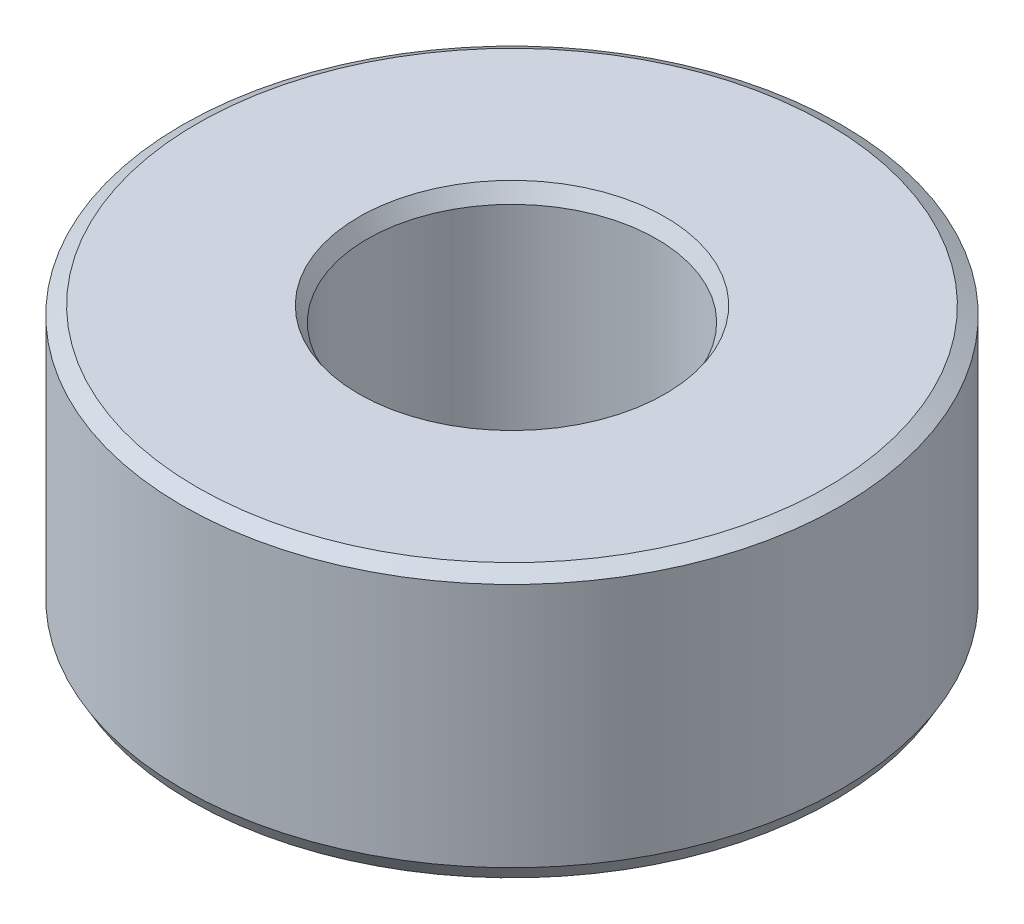
ISO-10303-21;
HEADER;
FILE_DESCRIPTION(('STEP AP214'),'2;1');
FILE_NAME('part.step','',(''),(''),'','','');
FILE_SCHEMA(('AUTOMOTIVE_DESIGN { 1 0 10303 214 1 1 1 1 }'));
ENDSEC;
DATA;
#1=APPLICATION_CONTEXT('core data for automotive mechanical design processes');
#2=APPLICATION_PROTOCOL_DEFINITION('international standard','automotive_design',2000,#1);
#3=PRODUCT_CONTEXT('',#1,'mechanical');
#4=PRODUCT('Part','Part','',(#3));
#5=PRODUCT_RELATED_PRODUCT_CATEGORY('part','',(#4));
#6=PRODUCT_DEFINITION_FORMATION('','',#4);
#7=PRODUCT_DEFINITION_CONTEXT('part definition',#1,'design');
#8=PRODUCT_DEFINITION('design','',#6,#7);
#9=PRODUCT_DEFINITION_SHAPE('','',#8);
#10=(LENGTH_UNIT() NAMED_UNIT(*) SI_UNIT(.MILLI.,.METRE.));
#11=(NAMED_UNIT(*) PLANE_ANGLE_UNIT() SI_UNIT($,.RADIAN.));
#12=(NAMED_UNIT(*) SI_UNIT($,.STERADIAN.) SOLID_ANGLE_UNIT());
#13=UNCERTAINTY_MEASURE_WITH_UNIT(LENGTH_MEASURE(1.E-05),#10,'distance_accuracy_value','');
#14=(GEOMETRIC_REPRESENTATION_CONTEXT(3) GLOBAL_UNCERTAINTY_ASSIGNED_CONTEXT((#13)) GLOBAL_UNIT_ASSIGNED_CONTEXT((#10,
#11,#12)) REPRESENTATION_CONTEXT('',''));
#15=CARTESIAN_POINT('',(0.,0.,0.));
#16=DIRECTION('',(0.,0.,1.));
#17=DIRECTION('',(1.,0.,0.));
#18=AXIS2_PLACEMENT_3D('',#15,#16,#17);
#19=CARTESIAN_POINT('',(0.,30.5505420791379,0.));
#20=DIRECTION('',(0.,-1.,0.));
#21=DIRECTION('',(0.,0.,-1.));
#22=AXIS2_PLACEMENT_3D('',#19,#20,#21);
#23=CYLINDRICAL_SURFACE('',#22,37.5);
#24=CARTESIAN_POINT('',(0.,1.67887617685251,0.));
#25=DIRECTION('',(0.,1.,0.));
#26=DIRECTION('',(0.,0.,1.));
#27=AXIS2_PLACEMENT_3D('',#24,#25,#26);
#28=CIRCLE('',#27,37.5);
#29=CARTESIAN_POINT('',(0.,1.67887617685251,37.5));
#30=VERTEX_POINT('',#29);
#31=EDGE_CURVE('E10',#30,#30,#28,.T.);
#32=ORIENTED_EDGE('',*,*,#31,.T.);
#33=EDGE_LOOP('',(#32));
#34=FACE_BOUND('',#33,.T.);
#35=CARTESIAN_POINT('',(0.,29.581242466496,0.));
#36=DIRECTION('',(0.,1.,0.));
#37=DIRECTION('',(0.,0.,1.));
#38=AXIS2_PLACEMENT_3D('',#35,#36,#37);
#39=CIRCLE('',#38,37.5);
#40=CARTESIAN_POINT('',(0.,29.581242466496,37.5));
#41=VERTEX_POINT('',#40);
#42=EDGE_CURVE('E50',#41,#41,#39,.F.);
#43=ORIENTED_EDGE('',*,*,#42,.T.);
#44=EDGE_LOOP('',(#43));
#45=FACE_BOUND('',#44,.T.);
#46=ADVANCED_FACE('F39',(#34,#45),#23,.T.);
#47=CARTESIAN_POINT('',(0.,30.5505420791379,0.));
#48=DIRECTION('',(0.,1.,0.));
#49=DIRECTION('',(0.,0.,1.));
#50=AXIS2_PLACEMENT_3D('',#47,#48,#49);
#51=PLANE('',#50);
#52=CARTESIAN_POINT('',(0.,30.5505420791379,0.));
#53=DIRECTION('',(0.,1.,0.));
#54=DIRECTION('',(0.,0.,1.));
#55=AXIS2_PLACEMENT_3D('',#52,#53,#54);
#56=CIRCLE('',#55,17.4312674834398);
#57=CARTESIAN_POINT('',(0.,30.5505420791379,17.4312674834398));
#58=VERTEX_POINT('',#57);
#59=EDGE_CURVE('E58',#58,#58,#56,.F.);
#60=ORIENTED_EDGE('',*,*,#59,.T.);
#61=EDGE_LOOP('',(#60));
#62=FACE_BOUND('',#61,.T.);
#63=CARTESIAN_POINT('',(0.,30.5505420791379,0.));
#64=DIRECTION('',(0.,1.,0.));
#65=DIRECTION('',(0.,0.,1.));
#66=AXIS2_PLACEMENT_3D('',#63,#64,#65);
#67=CIRCLE('',#66,35.8211238231475);
#68=CARTESIAN_POINT('',(0.,30.5505420791379,35.8211238231475));
#69=VERTEX_POINT('',#68);
#70=EDGE_CURVE('E61',#69,#69,#67,.T.);
#71=ORIENTED_EDGE('',*,*,#70,.T.);
#72=EDGE_LOOP('',(#71));
#73=FACE_BOUND('',#72,.T.);
#74=ADVANCED_FACE('F88',(#62,#73),#51,.T.);
#75=CARTESIAN_POINT('',(0.,0.,0.));
#76=DIRECTION('',(0.,1.,0.));
#77=DIRECTION('',(0.,0.,1.));
#78=AXIS2_PLACEMENT_3D('',#75,#76,#77);
#79=PLANE('',#78);
#80=CARTESIAN_POINT('',(0.,0.,0.));
#81=DIRECTION('',(0.,1.,0.));
#82=DIRECTION('',(0.,0.,1.));
#83=AXIS2_PLACEMENT_3D('',#80,#81,#82);
#84=CIRCLE('',#83,18.1408440476504);
#85=CARTESIAN_POINT('',(0.,0.,18.1408440476504));
#86=VERTEX_POINT('',#85);
#87=EDGE_CURVE('E51',#86,#86,#84,.T.);
#88=ORIENTED_EDGE('',*,*,#87,.T.);
#89=EDGE_LOOP('',(#88));
#90=FACE_BOUND('',#89,.T.);
#91=CARTESIAN_POINT('',(0.,0.,0.));
#92=DIRECTION('',(0.,1.,0.));
#93=DIRECTION('',(0.,0.,1.));
#94=AXIS2_PLACEMENT_3D('',#91,#92,#93);
#95=CIRCLE('',#94,36.5307003873581);
#96=CARTESIAN_POINT('',(0.,0.,36.5307003873581));
#97=VERTEX_POINT('',#96);
#98=EDGE_CURVE('E54',#97,#97,#95,.F.);
#99=ORIENTED_EDGE('',*,*,#98,.T.);
#100=EDGE_LOOP('',(#99));
#101=FACE_BOUND('',#100,.T.);
#102=ADVANCED_FACE('F83',(#90,#101),#79,.F.);
#103=CARTESIAN_POINT('',(0.,30.5505420791379,0.));
#104=DIRECTION('',(0.,-1.,0.));
#105=DIRECTION('',(0.,0.,-1.));
#106=AXIS2_PLACEMENT_3D('',#103,#104,#105);
#107=CYLINDRICAL_SURFACE('',#106,16.4619678707979);
#108=CARTESIAN_POINT('',(0.,28.8716659022853,0.));
#109=DIRECTION('',(0.,1.,0.));
#110=DIRECTION('',(0.,0.,1.));
#111=AXIS2_PLACEMENT_3D('',#108,#109,#110);
#112=CIRCLE('',#111,16.4619678707979);
#113=CARTESIAN_POINT('',(0.,28.8716659022853,16.4619678707979));
#114=VERTEX_POINT('',#113);
#115=EDGE_CURVE('E67',#114,#114,#112,.T.);
#116=ORIENTED_EDGE('',*,*,#115,.T.);
#117=EDGE_LOOP('',(#116));
#118=FACE_BOUND('',#117,.T.);
#119=CARTESIAN_POINT('',(0.,0.969299612641875,0.));
#120=DIRECTION('',(0.,1.,0.));
#121=DIRECTION('',(0.,0.,1.));
#122=AXIS2_PLACEMENT_3D('',#119,#120,#121);
#123=CIRCLE('',#122,16.4619678707979);
#124=CARTESIAN_POINT('',(0.,0.969299612641875,16.4619678707979));
#125=VERTEX_POINT('',#124);
#126=EDGE_CURVE('E69',#125,#125,#123,.F.);
#127=ORIENTED_EDGE('',*,*,#126,.T.);
#128=EDGE_LOOP('',(#127));
#129=FACE_BOUND('',#128,.T.);
#130=ADVANCED_FACE('F71',(#118,#129),#107,.F.);
#131=CARTESIAN_POINT('',(0.,28.8716659022853,0.));
#132=DIRECTION('',(0.,1.,0.));
#133=DIRECTION('',(0.,0.,1.));
#134=AXIS2_PLACEMENT_3D('',#131,#132,#133);
#135=CONICAL_SURFACE('',#134,16.4619678707979,0.523598775598305);
#136=ORIENTED_EDGE('',*,*,#59,.F.);
#137=EDGE_LOOP('',(#136));
#138=FACE_BOUND('',#137,.T.);
#139=ORIENTED_EDGE('',*,*,#115,.F.);
#140=EDGE_LOOP('',(#139));
#141=FACE_BOUND('',#140,.T.);
#142=ADVANCED_FACE('F77',(#138,#141),#135,.F.);
#143=CARTESIAN_POINT('',(0.,0.,0.));
#144=DIRECTION('',(0.,-1.,0.));
#145=DIRECTION('',(0.,0.,-1.));
#146=AXIS2_PLACEMENT_3D('',#143,#144,#145);
#147=CONICAL_SURFACE('',#146,18.1408440476504,1.04719755119659);
#148=ORIENTED_EDGE('',*,*,#126,.F.);
#149=EDGE_LOOP('',(#148));
#150=FACE_BOUND('',#149,.T.);
#151=ORIENTED_EDGE('',*,*,#87,.F.);
#152=EDGE_LOOP('',(#151));
#153=FACE_BOUND('',#152,.T.);
#154=ADVANCED_FACE('F73',(#150,#153),#147,.F.);
#155=CARTESIAN_POINT('',(0.,1.67887617685251,0.));
#156=DIRECTION('',(0.,1.,0.));
#157=DIRECTION('',(0.,0.,1.));
#158=AXIS2_PLACEMENT_3D('',#155,#156,#157);
#159=CONICAL_SURFACE('',#158,37.5,0.523598775598307);
#160=ORIENTED_EDGE('',*,*,#98,.F.);
#161=EDGE_LOOP('',(#160));
#162=FACE_BOUND('',#161,.T.);
#163=ORIENTED_EDGE('',*,*,#31,.F.);
#164=EDGE_LOOP('',(#163));
#165=FACE_BOUND('',#164,.T.);
#166=ADVANCED_FACE('F76',(#162,#165),#159,.T.);
#167=CARTESIAN_POINT('',(0.,30.5505420791379,0.));
#168=DIRECTION('',(0.,-1.,0.));
#169=DIRECTION('',(0.,0.,-1.));
#170=AXIS2_PLACEMENT_3D('',#167,#168,#169);
#171=CONICAL_SURFACE('',#170,35.8211238231475,1.04719755119659);
#172=ORIENTED_EDGE('',*,*,#42,.F.);
#173=EDGE_LOOP('',(#172));
#174=FACE_BOUND('',#173,.T.);
#175=ORIENTED_EDGE('',*,*,#70,.F.);
#176=EDGE_LOOP('',(#175));
#177=FACE_BOUND('',#176,.T.);
#178=ADVANCED_FACE('F45',(#174,#177),#171,.T.);
#179=CLOSED_SHELL('',(#46,#74,#102,#130,#142,#154,#166,#178));
#180=MANIFOLD_SOLID_BREP('B2',#179);
#181=ADVANCED_BREP_SHAPE_REPRESENTATION('',(#18,#180),#14);
#182=SHAPE_DEFINITION_REPRESENTATION(#9,#181);
ENDSEC;
END-ISO-10303-21;
